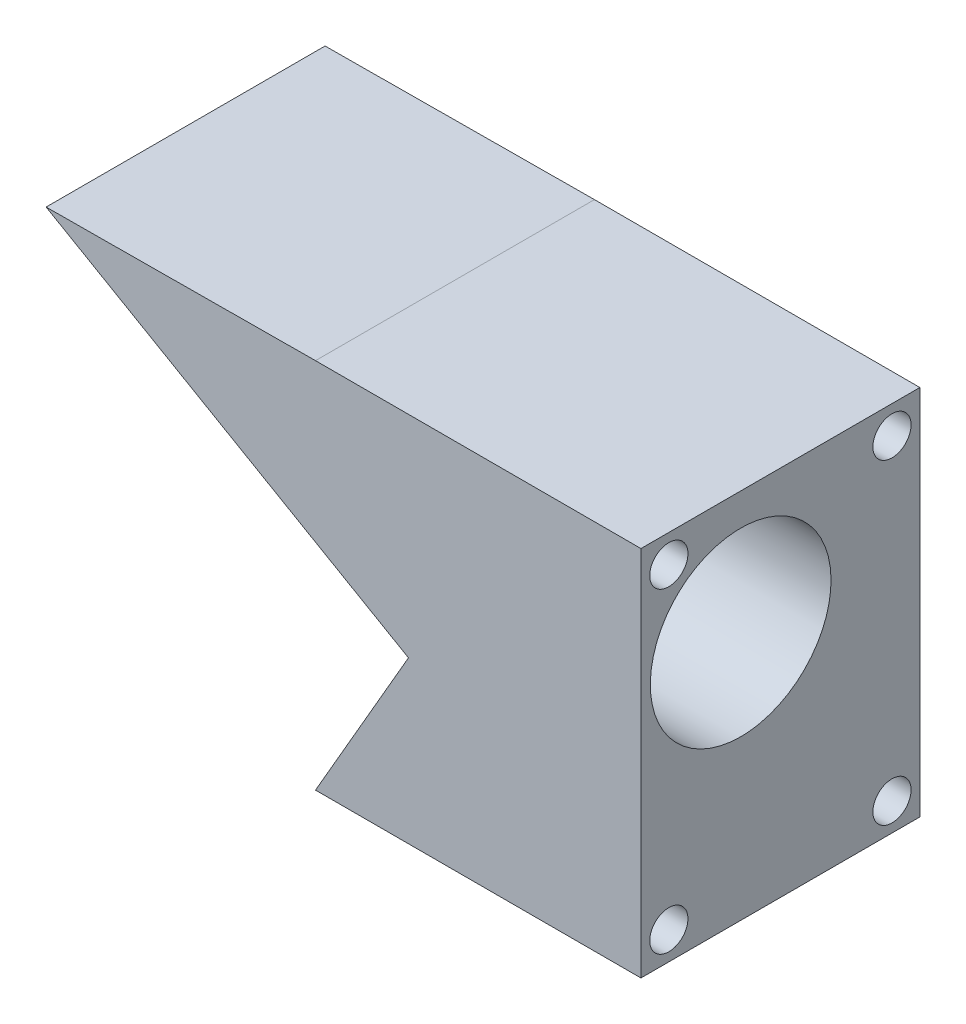
ISO-10303-21;
HEADER;
FILE_DESCRIPTION(('STEP AP214'),'2;1');
FILE_NAME('part.step','',(''),(''),'','','');
FILE_SCHEMA(('AUTOMOTIVE_DESIGN { 1 0 10303 214 1 1 1 1 }'));
ENDSEC;
DATA;
#1=APPLICATION_CONTEXT('core data for automotive mechanical design processes');
#2=APPLICATION_PROTOCOL_DEFINITION('international standard','automotive_design',2000,#1);
#3=PRODUCT_CONTEXT('',#1,'mechanical');
#4=PRODUCT('Part','Part','',(#3));
#5=PRODUCT_RELATED_PRODUCT_CATEGORY('part','',(#4));
#6=PRODUCT_DEFINITION_FORMATION('','',#4);
#7=PRODUCT_DEFINITION_CONTEXT('part definition',#1,'design');
#8=PRODUCT_DEFINITION('design','',#6,#7);
#9=PRODUCT_DEFINITION_SHAPE('','',#8);
#10=(LENGTH_UNIT() NAMED_UNIT(*) SI_UNIT(.MILLI.,.METRE.));
#11=(NAMED_UNIT(*) PLANE_ANGLE_UNIT() SI_UNIT($,.RADIAN.));
#12=(NAMED_UNIT(*) SI_UNIT($,.STERADIAN.) SOLID_ANGLE_UNIT());
#13=UNCERTAINTY_MEASURE_WITH_UNIT(LENGTH_MEASURE(1.E-05),#10,'distance_accuracy_value','');
#14=(GEOMETRIC_REPRESENTATION_CONTEXT(3) GLOBAL_UNCERTAINTY_ASSIGNED_CONTEXT((#13)) GLOBAL_UNIT_ASSIGNED_CONTEXT((#10,
#11,#12)) REPRESENTATION_CONTEXT('',''));
#15=CARTESIAN_POINT('',(0.,0.,0.));
#16=DIRECTION('',(0.,0.,1.));
#17=DIRECTION('',(1.,0.,0.));
#18=AXIS2_PLACEMENT_3D('',#15,#16,#17);
#19=CARTESIAN_POINT('',(-40.5200898437189,-24.4452012726537,38.1));
#20=DIRECTION('',(0.,1.,0.));
#21=DIRECTION('',(0.,0.,1.));
#22=AXIS2_PLACEMENT_3D('',#19,#20,#21);
#23=PLANE('',#22);
#24=DIRECTION('',(1.,0.,0.));
#25=VECTOR('',#24,1.);
#26=CARTESIAN_POINT('',(-40.5200898437189,-24.4452012726537,0.));
#27=LINE('',#26,#25);
#28=CARTESIAN_POINT('',(-40.5200898437189,-24.4452012726537,0.));
#29=VERTEX_POINT('',#28);
#30=CARTESIAN_POINT('',(3.92991015628107,-24.4452012726537,0.));
#31=VERTEX_POINT('',#30);
#32=EDGE_CURVE('E78',#29,#31,#27,.T.);
#33=ORIENTED_EDGE('',*,*,#32,.T.);
#34=DIRECTION('',(0.,0.,-1.));
#35=VECTOR('',#34,1.);
#36=CARTESIAN_POINT('',(3.92991015628107,-24.4452012726537,38.1));
#37=LINE('',#36,#35);
#38=CARTESIAN_POINT('',(3.92991015628107,-24.4452012726537,38.1));
#39=VERTEX_POINT('',#38);
#40=EDGE_CURVE('E73',#39,#31,#37,.T.);
#41=ORIENTED_EDGE('',*,*,#40,.F.);
#42=DIRECTION('',(1.,0.,0.));
#43=VECTOR('',#42,1.);
#44=CARTESIAN_POINT('',(-40.5200898437189,-24.4452012726537,38.1));
#45=LINE('',#44,#43);
#46=CARTESIAN_POINT('',(-40.5200898437189,-24.4452012726537,38.1));
#47=VERTEX_POINT('',#46);
#48=EDGE_CURVE('E93',#47,#39,#45,.T.);
#49=ORIENTED_EDGE('',*,*,#48,.F.);
#50=DIRECTION('',(0.,0.,-1.));
#51=VECTOR('',#50,1.);
#52=CARTESIAN_POINT('',(-40.5200898437189,-24.4452012726537,38.1));
#53=LINE('',#52,#51);
#54=EDGE_CURVE('E40',#47,#29,#53,.T.);
#55=ORIENTED_EDGE('',*,*,#54,.T.);
#56=EDGE_LOOP('',(#33,#41,#49,#55));
#57=FACE_BOUND('',#56,.T.);
#58=ADVANCED_FACE('F33',(#57),#23,.F.);
#59=CARTESIAN_POINT('',(3.92991015628107,26.3547987273463,38.1));
#60=DIRECTION('',(-1.,0.,0.));
#61=DIRECTION('',(0.,-1.,0.));
#62=AXIS2_PLACEMENT_3D('',#59,#60,#61);
#63=PLANE('',#62);
#64=CARTESIAN_POINT('',(3.92991015628107,9.61895089971776,24.4763703806323));
#65=DIRECTION('',(-1.,0.,0.));
#66=DIRECTION('',(0.,-1.,0.));
#67=AXIS2_PLACEMENT_3D('',#64,#65,#66);
#68=CIRCLE('',#67,12.3420151313158);
#69=CARTESIAN_POINT('',(3.92991015628107,-2.72306423159803,24.4763703806323));
#70=VERTEX_POINT('',#69);
#71=EDGE_CURVE('E131',#70,#70,#68,.T.);
#72=ORIENTED_EDGE('',*,*,#71,.T.);
#73=EDGE_LOOP('',(#72));
#74=FACE_BOUND('',#73,.T.);
#75=CARTESIAN_POINT('',(3.92991015628107,22.5447987273463,34.29));
#76=DIRECTION('',(1.,0.,0.));
#77=DIRECTION('',(0.,0.,-1.));
#78=AXIS2_PLACEMENT_3D('',#75,#76,#77);
#79=CIRCLE('',#78,2.60984999999999);
#80=CARTESIAN_POINT('',(3.92991015628107,22.5447987273463,31.68015));
#81=VERTEX_POINT('',#80);
#82=EDGE_CURVE('E146',#81,#81,#79,.T.);
#83=ORIENTED_EDGE('',*,*,#82,.F.);
#84=EDGE_LOOP('',(#83));
#85=FACE_BOUND('',#84,.T.);
#86=CARTESIAN_POINT('',(3.92991015628107,22.5447987273463,3.81));
#87=DIRECTION('',(1.,0.,0.));
#88=DIRECTION('',(0.,0.,-1.));
#89=AXIS2_PLACEMENT_3D('',#86,#87,#88);
#90=CIRCLE('',#89,2.60984999999999);
#91=CARTESIAN_POINT('',(3.92991015628107,22.5447987273463,1.20015000000001));
#92=VERTEX_POINT('',#91);
#93=EDGE_CURVE('E152',#92,#92,#90,.T.);
#94=ORIENTED_EDGE('',*,*,#93,.F.);
#95=EDGE_LOOP('',(#94));
#96=FACE_BOUND('',#95,.T.);
#97=CARTESIAN_POINT('',(3.92991015628107,-20.6352012726537,3.81));
#98=DIRECTION('',(1.,0.,0.));
#99=DIRECTION('',(0.,0.,-1.));
#100=AXIS2_PLACEMENT_3D('',#97,#98,#99);
#101=CIRCLE('',#100,2.60984999999999);
#102=CARTESIAN_POINT('',(3.92991015628107,-20.6352012726537,1.20015000000001));
#103=VERTEX_POINT('',#102);
#104=EDGE_CURVE('E158',#103,#103,#101,.T.);
#105=ORIENTED_EDGE('',*,*,#104,.F.);
#106=EDGE_LOOP('',(#105));
#107=FACE_BOUND('',#106,.T.);
#108=CARTESIAN_POINT('',(3.92991015628107,-20.6352012726537,34.29));
#109=DIRECTION('',(1.,0.,0.));
#110=DIRECTION('',(0.,0.,-1.));
#111=AXIS2_PLACEMENT_3D('',#108,#109,#110);
#112=CIRCLE('',#111,2.60984999999999);
#113=CARTESIAN_POINT('',(3.92991015628107,-20.6352012726537,31.68015));
#114=VERTEX_POINT('',#113);
#115=EDGE_CURVE('E164',#114,#114,#112,.T.);
#116=ORIENTED_EDGE('',*,*,#115,.F.);
#117=EDGE_LOOP('',(#116));
#118=FACE_BOUND('',#117,.T.);
#119=DIRECTION('',(0.,1.,0.));
#120=VECTOR('',#119,1.);
#121=CARTESIAN_POINT('',(3.92991015628107,26.3547987273463,0.));
#122=LINE('',#121,#120);
#123=CARTESIAN_POINT('',(3.92991015628107,26.3547987273463,0.));
#124=VERTEX_POINT('',#123);
#125=EDGE_CURVE('E67',#31,#124,#122,.T.);
#126=ORIENTED_EDGE('',*,*,#125,.T.);
#127=DIRECTION('',(0.,0.,-1.));
#128=VECTOR('',#127,1.);
#129=CARTESIAN_POINT('',(3.92991015628107,26.3547987273463,38.1));
#130=LINE('',#129,#128);
#131=CARTESIAN_POINT('',(3.92991015628107,26.3547987273463,38.1));
#132=VERTEX_POINT('',#131);
#133=EDGE_CURVE('E70',#132,#124,#130,.T.);
#134=ORIENTED_EDGE('',*,*,#133,.F.);
#135=DIRECTION('',(0.,1.,0.));
#136=VECTOR('',#135,1.);
#137=CARTESIAN_POINT('',(3.92991015628107,26.3547987273463,38.1));
#138=LINE('',#137,#136);
#139=EDGE_CURVE('E54',#39,#132,#138,.T.);
#140=ORIENTED_EDGE('',*,*,#139,.F.);
#141=ORIENTED_EDGE('',*,*,#40,.T.);
#142=EDGE_LOOP('',(#126,#134,#140,#141));
#143=FACE_BOUND('',#142,.T.);
#144=ADVANCED_FACE('F69',(#74,#85,#96,#107,#118,#143),#63,.F.);
#145=CARTESIAN_POINT('',(-40.5200898437189,26.3547987273463,38.1));
#146=DIRECTION('',(0.,-1.,0.));
#147=DIRECTION('',(0.,0.,-1.));
#148=AXIS2_PLACEMENT_3D('',#145,#146,#147);
#149=PLANE('',#148);
#150=DIRECTION('',(-1.,0.,0.));
#151=VECTOR('',#150,1.);
#152=CARTESIAN_POINT('',(-40.5200898437189,26.3547987273463,0.));
#153=LINE('',#152,#151);
#154=CARTESIAN_POINT('',(-40.5200898437189,26.3547987273463,0.));
#155=VERTEX_POINT('',#154);
#156=EDGE_CURVE('E77',#124,#155,#153,.T.);
#157=ORIENTED_EDGE('',*,*,#156,.T.);
#158=DIRECTION('',(0.,0.,-1.));
#159=VECTOR('',#158,1.);
#160=CARTESIAN_POINT('',(-40.5200898437189,26.3547987273463,38.1));
#161=LINE('',#160,#159);
#162=CARTESIAN_POINT('',(-40.5200898437189,26.3547987273463,38.1));
#163=VERTEX_POINT('',#162);
#164=EDGE_CURVE('E86',#163,#155,#161,.T.);
#165=ORIENTED_EDGE('',*,*,#164,.F.);
#166=DIRECTION('',(-1.,0.,0.));
#167=VECTOR('',#166,1.);
#168=CARTESIAN_POINT('',(-40.5200898437189,26.3547987273463,38.1));
#169=LINE('',#168,#167);
#170=EDGE_CURVE('E85',#132,#163,#169,.T.);
#171=ORIENTED_EDGE('',*,*,#170,.F.);
#172=ORIENTED_EDGE('',*,*,#133,.T.);
#173=EDGE_LOOP('',(#157,#165,#171,#172));
#174=FACE_BOUND('',#173,.T.);
#175=ADVANCED_FACE('F82',(#174),#149,.F.);
#176=CARTESIAN_POINT('',(0.,0.,38.1));
#177=DIRECTION('',(0.,0.,1.));
#178=DIRECTION('',(1.,0.,0.));
#179=AXIS2_PLACEMENT_3D('',#176,#177,#178);
#180=PLANE('',#179);
#181=DIRECTION('',(-0.5,-0.866025403784438,0.));
#182=VECTOR('',#181,1.);
#183=CARTESIAN_POINT('',(-27.8200898437189,-2.44815601652894,38.1));
#184=LINE('',#183,#182);
#185=CARTESIAN_POINT('',(-27.8200898437189,-2.44815601652894,38.1));
#186=VERTEX_POINT('',#185);
#187=EDGE_CURVE('E115',#186,#47,#184,.T.);
#188=ORIENTED_EDGE('',*,*,#187,.T.);
#189=ORIENTED_EDGE('',*,*,#48,.T.);
#190=ORIENTED_EDGE('',*,*,#139,.T.);
#191=ORIENTED_EDGE('',*,*,#170,.T.);
#192=DIRECTION('',(0.999980808184302,0.00619542275153397,0.));
#193=VECTOR('',#192,1.);
#194=CARTESIAN_POINT('',(-40.5200898437189,26.3547987273463,38.1));
#195=LINE('',#194,#193);
#196=CARTESIAN_POINT('',(-77.3134416699996,26.1268439834711,38.1));
#197=VERTEX_POINT('',#196);
#198=EDGE_CURVE('E138',#197,#163,#195,.T.);
#199=ORIENTED_EDGE('',*,*,#198,.F.);
#200=DIRECTION('',(-0.866025403784439,0.5,0.));
#201=VECTOR('',#200,1.);
#202=CARTESIAN_POINT('',(-77.3134416699996,26.1268439834711,38.1));
#203=LINE('',#202,#201);
#204=EDGE_CURVE('E125',#186,#197,#203,.T.);
#205=ORIENTED_EDGE('',*,*,#204,.F.);
#206=EDGE_LOOP('',(#188,#189,#190,#191,#199,#205));
#207=FACE_BOUND('',#206,.T.);
#208=ADVANCED_FACE('F122',(#207),#180,.T.);
#209=CARTESIAN_POINT('',(0.,0.,0.));
#210=DIRECTION('',(0.,0.,1.));
#211=DIRECTION('',(1.,0.,0.));
#212=AXIS2_PLACEMENT_3D('',#209,#210,#211);
#213=PLANE('',#212);
#214=ORIENTED_EDGE('',*,*,#32,.F.);
#215=DIRECTION('',(-0.5,-0.866025403784438,0.));
#216=VECTOR('',#215,1.);
#217=CARTESIAN_POINT('',(-27.8200898437189,-2.44815601652894,0.));
#218=LINE('',#217,#216);
#219=CARTESIAN_POINT('',(-27.8200898437189,-2.44815601652894,0.));
#220=VERTEX_POINT('',#219);
#221=EDGE_CURVE('E118',#220,#29,#218,.T.);
#222=ORIENTED_EDGE('',*,*,#221,.F.);
#223=DIRECTION('',(-0.866025403784439,0.5,0.));
#224=VECTOR('',#223,1.);
#225=CARTESIAN_POINT('',(-77.3134416699996,26.1268439834711,0.));
#226=LINE('',#225,#224);
#227=CARTESIAN_POINT('',(-77.3134416699996,26.1268439834711,0.));
#228=VERTEX_POINT('',#227);
#229=EDGE_CURVE('E136',#220,#228,#226,.T.);
#230=ORIENTED_EDGE('',*,*,#229,.T.);
#231=DIRECTION('',(0.999980808184302,0.00619542275153397,0.));
#232=VECTOR('',#231,1.);
#233=CARTESIAN_POINT('',(-40.5200898437189,26.3547987273463,0.));
#234=LINE('',#233,#232);
#235=EDGE_CURVE('E92',#228,#155,#234,.T.);
#236=ORIENTED_EDGE('',*,*,#235,.T.);
#237=ORIENTED_EDGE('',*,*,#156,.F.);
#238=ORIENTED_EDGE('',*,*,#125,.F.);
#239=EDGE_LOOP('',(#214,#222,#230,#236,#237,#238));
#240=FACE_BOUND('',#239,.T.);
#241=ADVANCED_FACE('F89',(#240),#213,.F.);
#242=CARTESIAN_POINT('',(-8.77008984371893,-20.6352012726537,34.29));
#243=DIRECTION('',(1.,0.,0.));
#244=DIRECTION('',(0.,0.,-1.));
#245=AXIS2_PLACEMENT_3D('',#242,#243,#244);
#246=CONICAL_SURFACE('',#245,2.60985,1.02974425867665);
#247=CARTESIAN_POINT('',(-10.338245930288,-20.6352012726537,34.29));
#248=VERTEX_POINT('',#247);
#249=VERTEX_LOOP('',#248);
#250=FACE_BOUND('',#249,.T.);
#251=CARTESIAN_POINT('',(-8.77008984371893,-20.6352012726537,34.29));
#252=DIRECTION('',(1.,0.,0.));
#253=DIRECTION('',(0.,0.,-1.));
#254=AXIS2_PLACEMENT_3D('',#251,#252,#253);
#255=CIRCLE('',#254,2.60985);
#256=CARTESIAN_POINT('',(-8.77008984371893,-20.6352012726537,31.68015));
#257=VERTEX_POINT('',#256);
#258=EDGE_CURVE('E167',#257,#257,#255,.T.);
#259=ORIENTED_EDGE('',*,*,#258,.T.);
#260=EDGE_LOOP('',(#259));
#261=FACE_BOUND('',#260,.T.);
#262=ADVANCED_FACE('F191',(#250,#261),#246,.F.);
#263=CARTESIAN_POINT('',(3.92991015628107,-20.6352012726537,34.29));
#264=DIRECTION('',(1.,0.,0.));
#265=DIRECTION('',(0.,0.,-1.));
#266=AXIS2_PLACEMENT_3D('',#263,#264,#265);
#267=CYLINDRICAL_SURFACE('',#266,2.60984999999999);
#268=ORIENTED_EDGE('',*,*,#258,.F.);
#269=EDGE_LOOP('',(#268));
#270=FACE_BOUND('',#269,.T.);
#271=ORIENTED_EDGE('',*,*,#115,.T.);
#272=EDGE_LOOP('',(#271));
#273=FACE_BOUND('',#272,.T.);
#274=ADVANCED_FACE('F194',(#270,#273),#267,.F.);
#275=CARTESIAN_POINT('',(-8.77008984371893,-20.6352012726537,3.81));
#276=DIRECTION('',(1.,0.,0.));
#277=DIRECTION('',(0.,0.,-1.));
#278=AXIS2_PLACEMENT_3D('',#275,#276,#277);
#279=CONICAL_SURFACE('',#278,2.60985,1.02974425867665);
#280=CARTESIAN_POINT('',(-10.338245930288,-20.6352012726537,3.81));
#281=VERTEX_POINT('',#280);
#282=VERTEX_LOOP('',#281);
#283=FACE_BOUND('',#282,.T.);
#284=CARTESIAN_POINT('',(-8.77008984371893,-20.6352012726537,3.81));
#285=DIRECTION('',(1.,0.,0.));
#286=DIRECTION('',(0.,0.,-1.));
#287=AXIS2_PLACEMENT_3D('',#284,#285,#286);
#288=CIRCLE('',#287,2.60985);
#289=CARTESIAN_POINT('',(-8.77008984371893,-20.6352012726537,1.20015));
#290=VERTEX_POINT('',#289);
#291=EDGE_CURVE('E161',#290,#290,#288,.T.);
#292=ORIENTED_EDGE('',*,*,#291,.T.);
#293=EDGE_LOOP('',(#292));
#294=FACE_BOUND('',#293,.T.);
#295=ADVANCED_FACE('F200',(#283,#294),#279,.F.);
#296=CARTESIAN_POINT('',(3.92991015628107,-20.6352012726537,3.81));
#297=DIRECTION('',(1.,0.,0.));
#298=DIRECTION('',(0.,0.,-1.));
#299=AXIS2_PLACEMENT_3D('',#296,#297,#298);
#300=CYLINDRICAL_SURFACE('',#299,2.60984999999999);
#301=ORIENTED_EDGE('',*,*,#291,.F.);
#302=EDGE_LOOP('',(#301));
#303=FACE_BOUND('',#302,.T.);
#304=ORIENTED_EDGE('',*,*,#104,.T.);
#305=EDGE_LOOP('',(#304));
#306=FACE_BOUND('',#305,.T.);
#307=ADVANCED_FACE('F220',(#303,#306),#300,.F.);
#308=CARTESIAN_POINT('',(-8.77008984371893,22.5447987273463,3.81));
#309=DIRECTION('',(1.,0.,0.));
#310=DIRECTION('',(0.,0.,-1.));
#311=AXIS2_PLACEMENT_3D('',#308,#309,#310);
#312=CONICAL_SURFACE('',#311,2.60985,1.02974425867665);
#313=CARTESIAN_POINT('',(-10.338245930288,22.5447987273463,3.81));
#314=VERTEX_POINT('',#313);
#315=VERTEX_LOOP('',#314);
#316=FACE_BOUND('',#315,.T.);
#317=CARTESIAN_POINT('',(-8.77008984371893,22.5447987273463,3.81));
#318=DIRECTION('',(1.,0.,0.));
#319=DIRECTION('',(0.,0.,-1.));
#320=AXIS2_PLACEMENT_3D('',#317,#318,#319);
#321=CIRCLE('',#320,2.60985);
#322=CARTESIAN_POINT('',(-8.77008984371893,22.5447987273463,1.20015));
#323=VERTEX_POINT('',#322);
#324=EDGE_CURVE('E155',#323,#323,#321,.T.);
#325=ORIENTED_EDGE('',*,*,#324,.T.);
#326=EDGE_LOOP('',(#325));
#327=FACE_BOUND('',#326,.T.);
#328=ADVANCED_FACE('F224',(#316,#327),#312,.F.);
#329=CARTESIAN_POINT('',(3.92991015628107,22.5447987273463,3.81));
#330=DIRECTION('',(1.,0.,0.));
#331=DIRECTION('',(0.,0.,-1.));
#332=AXIS2_PLACEMENT_3D('',#329,#330,#331);
#333=CYLINDRICAL_SURFACE('',#332,2.60984999999999);
#334=ORIENTED_EDGE('',*,*,#324,.F.);
#335=EDGE_LOOP('',(#334));
#336=FACE_BOUND('',#335,.T.);
#337=ORIENTED_EDGE('',*,*,#93,.T.);
#338=EDGE_LOOP('',(#337));
#339=FACE_BOUND('',#338,.T.);
#340=ADVANCED_FACE('F228',(#336,#339),#333,.F.);
#341=CARTESIAN_POINT('',(-8.77008984371893,22.5447987273463,34.29));
#342=DIRECTION('',(1.,0.,0.));
#343=DIRECTION('',(0.,0.,-1.));
#344=AXIS2_PLACEMENT_3D('',#341,#342,#343);
#345=CONICAL_SURFACE('',#344,2.60985,1.02974425867665);
#346=CARTESIAN_POINT('',(-10.338245930288,22.5447987273463,34.29));
#347=VERTEX_POINT('',#346);
#348=VERTEX_LOOP('',#347);
#349=FACE_BOUND('',#348,.T.);
#350=CARTESIAN_POINT('',(-8.77008984371893,22.5447987273463,34.29));
#351=DIRECTION('',(1.,0.,0.));
#352=DIRECTION('',(0.,0.,-1.));
#353=AXIS2_PLACEMENT_3D('',#350,#351,#352);
#354=CIRCLE('',#353,2.60985);
#355=CARTESIAN_POINT('',(-8.77008984371893,22.5447987273463,31.68015));
#356=VERTEX_POINT('',#355);
#357=EDGE_CURVE('E149',#356,#356,#354,.T.);
#358=ORIENTED_EDGE('',*,*,#357,.T.);
#359=EDGE_LOOP('',(#358));
#360=FACE_BOUND('',#359,.T.);
#361=ADVANCED_FACE('F232',(#349,#360),#345,.F.);
#362=CARTESIAN_POINT('',(3.92991015628107,22.5447987273463,34.29));
#363=DIRECTION('',(1.,0.,0.));
#364=DIRECTION('',(0.,0.,-1.));
#365=AXIS2_PLACEMENT_3D('',#362,#363,#364);
#366=CYLINDRICAL_SURFACE('',#365,2.60984999999999);
#367=ORIENTED_EDGE('',*,*,#357,.F.);
#368=EDGE_LOOP('',(#367));
#369=FACE_BOUND('',#368,.T.);
#370=ORIENTED_EDGE('',*,*,#82,.T.);
#371=EDGE_LOOP('',(#370));
#372=FACE_BOUND('',#371,.T.);
#373=ADVANCED_FACE('F236',(#369,#372),#366,.F.);
#374=CARTESIAN_POINT('',(-40.5200898437189,26.3547987273463,38.1));
#375=DIRECTION('',(-0.00619542275153397,0.999980808184302,0.));
#376=DIRECTION('',(-0.999980808184302,-0.00619542275153397,0.));
#377=AXIS2_PLACEMENT_3D('',#374,#375,#376);
#378=PLANE('',#377);
#379=ORIENTED_EDGE('',*,*,#235,.F.);
#380=DIRECTION('',(0.,0.,-1.));
#381=VECTOR('',#380,1.);
#382=CARTESIAN_POINT('',(-77.3134416699996,26.1268439834711,38.1));
#383=LINE('',#382,#381);
#384=EDGE_CURVE('E141',#197,#228,#383,.T.);
#385=ORIENTED_EDGE('',*,*,#384,.F.);
#386=ORIENTED_EDGE('',*,*,#198,.T.);
#387=ORIENTED_EDGE('',*,*,#164,.T.);
#388=EDGE_LOOP('',(#379,#385,#386,#387));
#389=FACE_BOUND('',#388,.T.);
#390=ADVANCED_FACE('F176',(#389),#378,.T.);
#391=CARTESIAN_POINT('',(-77.3134416699996,26.1268439834711,38.1));
#392=DIRECTION('',(-0.5,-0.866025403784439,0.));
#393=DIRECTION('',(0.866025403784439,-0.5,0.));
#394=AXIS2_PLACEMENT_3D('',#391,#392,#393);
#395=PLANE('',#394);
#396=CARTESIAN_POINT('',(-48.7209321230239,9.61895089971775,24.4763703806323));
#397=DIRECTION('',(-0.5,-0.866025403784439,0.));
#398=DIRECTION('',(0.866025403784439,-0.5,0.));
#399=AXIS2_PLACEMENT_3D('',#396,#397,#398);
#400=ELLIPSE('',#399,24.6840302626316,12.3420151313158);
#401=CARTESIAN_POINT('',(-27.8200898437189,-2.44815601652894,27.0667889131284));
#402=VERTEX_POINT('',#401);
#403=CARTESIAN_POINT('',(-27.8200898437189,-2.44815601652894,21.8859518481361));
#404=VERTEX_POINT('',#403);
#405=EDGE_CURVE('E46',#402,#404,#400,.T.);
#406=ORIENTED_EDGE('',*,*,#405,.F.);
#407=DIRECTION('',(0.,0.,-1.));
#408=VECTOR('',#407,1.);
#409=CARTESIAN_POINT('',(-27.8200898437189,-2.44815601652894,38.1));
#410=LINE('',#409,#408);
#411=EDGE_CURVE('E129',#186,#402,#410,.T.);
#412=ORIENTED_EDGE('',*,*,#411,.F.);
#413=ORIENTED_EDGE('',*,*,#204,.T.);
#414=ORIENTED_EDGE('',*,*,#384,.T.);
#415=ORIENTED_EDGE('',*,*,#229,.F.);
#416=EDGE_CURVE('E127',#404,#220,#410,.T.);
#417=ORIENTED_EDGE('',*,*,#416,.F.);
#418=EDGE_LOOP('',(#406,#412,#413,#414,#415,#417));
#419=FACE_BOUND('',#418,.T.);
#420=ADVANCED_FACE('F241',(#419),#395,.T.);
#421=CARTESIAN_POINT('',(-27.8200898437189,-2.44815601652894,38.1));
#422=DIRECTION('',(0.866025403784438,-0.5,0.));
#423=DIRECTION('',(0.5,0.866025403784438,0.));
#424=AXIS2_PLACEMENT_3D('',#421,#422,#423);
#425=PLANE('',#424);
#426=ORIENTED_EDGE('',*,*,#411,.T.);
#427=CARTESIAN_POINT('',(-20.8531424172839,9.61895089971775,24.4763703806323));
#428=DIRECTION('',(0.866025403784438,-0.5,0.));
#429=DIRECTION('',(0.5,0.866025403784438,0.));
#430=AXIS2_PLACEMENT_3D('',#427,#428,#429);
#431=ELLIPSE('',#430,14.2513315168152,12.3420151313158);
#432=EDGE_CURVE('E11',#402,#404,#431,.T.);
#433=ORIENTED_EDGE('',*,*,#432,.T.);
#434=ORIENTED_EDGE('',*,*,#416,.T.);
#435=ORIENTED_EDGE('',*,*,#221,.T.);
#436=ORIENTED_EDGE('',*,*,#54,.F.);
#437=ORIENTED_EDGE('',*,*,#187,.F.);
#438=EDGE_LOOP('',(#426,#433,#434,#435,#436,#437));
#439=FACE_BOUND('',#438,.T.);
#440=ADVANCED_FACE('F114',(#439),#425,.F.);
#441=CARTESIAN_POINT('',(-77.3134416699996,9.61895089971774,24.4763703806323));
#442=DIRECTION('',(1.,0.,0.));
#443=DIRECTION('',(0.,1.,0.));
#444=AXIS2_PLACEMENT_3D('',#441,#442,#443);
#445=CYLINDRICAL_SURFACE('',#444,12.3420151313158);
#446=ORIENTED_EDGE('',*,*,#405,.T.);
#447=ORIENTED_EDGE('',*,*,#432,.F.);
#448=EDGE_LOOP('',(#446,#447));
#449=FACE_BOUND('',#448,.T.);
#450=ORIENTED_EDGE('',*,*,#71,.F.);
#451=EDGE_LOOP('',(#450));
#452=FACE_BOUND('',#451,.T.);
#453=ADVANCED_FACE('F249',(#449,#452),#445,.F.);
#454=CLOSED_SHELL('',(#58,#144,#175,#208,#241,#262,#274,#295,#307,#328,#340,#361,#373,#390,#420,
#440,#453));
#455=MANIFOLD_SOLID_BREP('B2',#454);
#456=ADVANCED_BREP_SHAPE_REPRESENTATION('',(#18,#455),#14);
#457=SHAPE_DEFINITION_REPRESENTATION(#9,#456);
ENDSEC;
END-ISO-10303-21;
